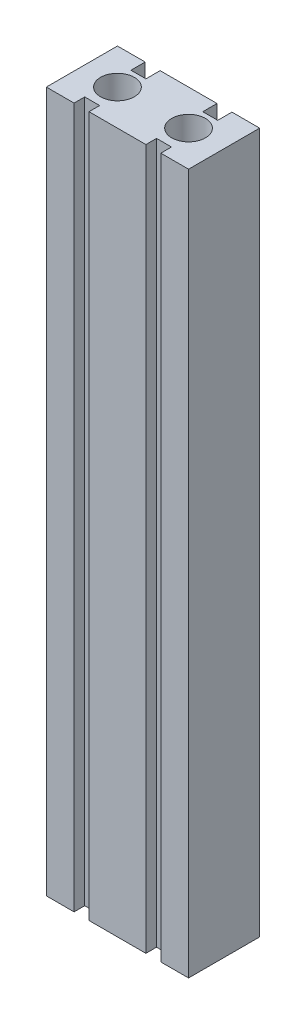
ISO-10303-21;
HEADER;
FILE_DESCRIPTION(('STEP AP214'),'2;1');
FILE_NAME('part.step','',(''),(''),'','','');
FILE_SCHEMA(('AUTOMOTIVE_DESIGN { 1 0 10303 214 1 1 1 1 }'));
ENDSEC;
DATA;
#1=APPLICATION_CONTEXT('core data for automotive mechanical design processes');
#2=APPLICATION_PROTOCOL_DEFINITION('international standard','automotive_design',2000,#1);
#3=PRODUCT_CONTEXT('',#1,'mechanical');
#4=PRODUCT('Part','Part','',(#3));
#5=PRODUCT_RELATED_PRODUCT_CATEGORY('part','',(#4));
#6=PRODUCT_DEFINITION_FORMATION('','',#4);
#7=PRODUCT_DEFINITION_CONTEXT('part definition',#1,'design');
#8=PRODUCT_DEFINITION('design','',#6,#7);
#9=PRODUCT_DEFINITION_SHAPE('','',#8);
#10=(LENGTH_UNIT() NAMED_UNIT(*) SI_UNIT(.MILLI.,.METRE.));
#11=(NAMED_UNIT(*) PLANE_ANGLE_UNIT() SI_UNIT($,.RADIAN.));
#12=(NAMED_UNIT(*) SI_UNIT($,.STERADIAN.) SOLID_ANGLE_UNIT());
#13=UNCERTAINTY_MEASURE_WITH_UNIT(LENGTH_MEASURE(1.E-05),#10,'distance_accuracy_value','');
#14=(GEOMETRIC_REPRESENTATION_CONTEXT(3) GLOBAL_UNCERTAINTY_ASSIGNED_CONTEXT((#13)) GLOBAL_UNIT_ASSIGNED_CONTEXT((#10,
#11,#12)) REPRESENTATION_CONTEXT('',''));
#15=CARTESIAN_POINT('',(0.,0.,0.));
#16=DIRECTION('',(0.,0.,1.));
#17=DIRECTION('',(1.,0.,0.));
#18=AXIS2_PLACEMENT_3D('',#15,#16,#17);
#19=CARTESIAN_POINT('',(-20.,197.,-10.));
#20=DIRECTION('',(0.,0.,1.));
#21=DIRECTION('',(1.,0.,0.));
#22=AXIS2_PLACEMENT_3D('',#19,#20,#21);
#23=PLANE('',#22);
#24=DIRECTION('',(-1.,0.,0.));
#25=VECTOR('',#24,1.);
#26=CARTESIAN_POINT('',(-20.,0.,-10.));
#27=LINE('',#26,#25);
#28=CARTESIAN_POINT('',(20.,0.,-10.));
#29=VERTEX_POINT('',#28);
#30=CARTESIAN_POINT('',(12.2,0.,-10.));
#31=VERTEX_POINT('',#30);
#32=EDGE_CURVE('E356',#29,#31,#27,.T.);
#33=ORIENTED_EDGE('',*,*,#32,.T.);
#34=DIRECTION('',(0.,-1.,0.));
#35=VECTOR('',#34,1.);
#36=CARTESIAN_POINT('',(12.2,197.,-10.));
#37=LINE('',#36,#35);
#38=CARTESIAN_POINT('',(12.2,197.,-10.));
#39=VERTEX_POINT('',#38);
#40=EDGE_CURVE('E234',#39,#31,#37,.T.);
#41=ORIENTED_EDGE('',*,*,#40,.F.);
#42=DIRECTION('',(-1.,0.,0.));
#43=VECTOR('',#42,1.);
#44=CARTESIAN_POINT('',(-20.,197.,-10.));
#45=LINE('',#44,#43);
#46=CARTESIAN_POINT('',(20.,197.,-10.));
#47=VERTEX_POINT('',#46);
#48=EDGE_CURVE('E337',#47,#39,#45,.T.);
#49=ORIENTED_EDGE('',*,*,#48,.F.);
#50=DIRECTION('',(0.,-1.,0.));
#51=VECTOR('',#50,1.);
#52=CARTESIAN_POINT('',(20.,197.,-10.));
#53=LINE('',#52,#51);
#54=EDGE_CURVE('E11',#47,#29,#53,.T.);
#55=ORIENTED_EDGE('',*,*,#54,.T.);
#56=EDGE_LOOP('',(#33,#41,#49,#55));
#57=FACE_BOUND('',#56,.T.);
#58=ADVANCED_FACE('F39',(#57),#23,.F.);
#59=CARTESIAN_POINT('',(-12.2,197.,-10.));
#60=VERTEX_POINT('',#59);
#61=CARTESIAN_POINT('',(-20.,197.,-10.));
#62=VERTEX_POINT('',#61);
#63=EDGE_CURVE('E335',#60,#62,#45,.T.);
#64=ORIENTED_EDGE('',*,*,#63,.F.);
#65=DIRECTION('',(0.,1.,0.));
#66=VECTOR('',#65,1.);
#67=CARTESIAN_POINT('',(-12.2,0.,-10.));
#68=LINE('',#67,#66);
#69=CARTESIAN_POINT('',(-12.2,0.,-10.));
#70=VERTEX_POINT('',#69);
#71=EDGE_CURVE('E226',#70,#60,#68,.T.);
#72=ORIENTED_EDGE('',*,*,#71,.F.);
#73=CARTESIAN_POINT('',(-20.,0.,-10.));
#74=VERTEX_POINT('',#73);
#75=EDGE_CURVE('E355',#70,#74,#27,.T.);
#76=ORIENTED_EDGE('',*,*,#75,.T.);
#77=DIRECTION('',(0.,-1.,0.));
#78=VECTOR('',#77,1.);
#79=CARTESIAN_POINT('',(-20.,197.,-10.));
#80=LINE('',#79,#78);
#81=EDGE_CURVE('E48',#62,#74,#80,.T.);
#82=ORIENTED_EDGE('',*,*,#81,.F.);
#83=EDGE_LOOP('',(#64,#72,#76,#82));
#84=FACE_BOUND('',#83,.T.);
#85=ADVANCED_FACE('F416',(#84),#23,.F.);
#86=CARTESIAN_POINT('',(-20.,197.,10.));
#87=DIRECTION('',(0.,0.,-1.));
#88=DIRECTION('',(-1.,0.,0.));
#89=AXIS2_PLACEMENT_3D('',#86,#87,#88);
#90=PLANE('',#89);
#91=DIRECTION('',(1.,0.,0.));
#92=VECTOR('',#91,1.);
#93=CARTESIAN_POINT('',(-20.,0.,10.));
#94=LINE('',#93,#92);
#95=CARTESIAN_POINT('',(-20.,0.,10.));
#96=VERTEX_POINT('',#95);
#97=CARTESIAN_POINT('',(-12.2,0.,10.));
#98=VERTEX_POINT('',#97);
#99=EDGE_CURVE('E336',#96,#98,#94,.T.);
#100=ORIENTED_EDGE('',*,*,#99,.T.);
#101=DIRECTION('',(0.,-1.,0.));
#102=VECTOR('',#101,1.);
#103=CARTESIAN_POINT('',(-12.2,0.,10.));
#104=LINE('',#103,#102);
#105=CARTESIAN_POINT('',(-12.2,197.,10.));
#106=VERTEX_POINT('',#105);
#107=EDGE_CURVE('E261',#106,#98,#104,.T.);
#108=ORIENTED_EDGE('',*,*,#107,.F.);
#109=DIRECTION('',(1.,0.,0.));
#110=VECTOR('',#109,1.);
#111=CARTESIAN_POINT('',(-20.,197.,10.));
#112=LINE('',#111,#110);
#113=CARTESIAN_POINT('',(-20.,197.,10.));
#114=VERTEX_POINT('',#113);
#115=EDGE_CURVE('E346',#114,#106,#112,.T.);
#116=ORIENTED_EDGE('',*,*,#115,.F.);
#117=DIRECTION('',(0.,-1.,0.));
#118=VECTOR('',#117,1.);
#119=CARTESIAN_POINT('',(-20.,197.,10.));
#120=LINE('',#119,#118);
#121=EDGE_CURVE('E371',#114,#96,#120,.T.);
#122=ORIENTED_EDGE('',*,*,#121,.T.);
#123=EDGE_LOOP('',(#100,#108,#116,#122));
#124=FACE_BOUND('',#123,.T.);
#125=ADVANCED_FACE('F391',(#124),#90,.F.);
#126=CARTESIAN_POINT('',(12.2,197.,10.));
#127=VERTEX_POINT('',#126);
#128=CARTESIAN_POINT('',(20.,197.,10.));
#129=VERTEX_POINT('',#128);
#130=EDGE_CURVE('E345',#127,#129,#112,.T.);
#131=ORIENTED_EDGE('',*,*,#130,.F.);
#132=DIRECTION('',(0.,1.,0.));
#133=VECTOR('',#132,1.);
#134=CARTESIAN_POINT('',(12.2,0.,10.));
#135=LINE('',#134,#133);
#136=CARTESIAN_POINT('',(12.2,0.,10.));
#137=VERTEX_POINT('',#136);
#138=EDGE_CURVE('E298',#137,#127,#135,.T.);
#139=ORIENTED_EDGE('',*,*,#138,.F.);
#140=CARTESIAN_POINT('',(20.,0.,10.));
#141=VERTEX_POINT('',#140);
#142=EDGE_CURVE('E363',#137,#141,#94,.T.);
#143=ORIENTED_EDGE('',*,*,#142,.T.);
#144=DIRECTION('',(0.,-1.,0.));
#145=VECTOR('',#144,1.);
#146=CARTESIAN_POINT('',(20.,197.,10.));
#147=LINE('',#146,#145);
#148=EDGE_CURVE('E350',#129,#141,#147,.T.);
#149=ORIENTED_EDGE('',*,*,#148,.F.);
#150=EDGE_LOOP('',(#131,#139,#143,#149));
#151=FACE_BOUND('',#150,.T.);
#152=ADVANCED_FACE('F445',(#151),#90,.F.);
#153=CARTESIAN_POINT('',(20.,197.,-10.));
#154=DIRECTION('',(-1.,0.,0.));
#155=DIRECTION('',(0.,0.,1.));
#156=AXIS2_PLACEMENT_3D('',#153,#154,#155);
#157=PLANE('',#156);
#158=DIRECTION('',(0.,0.,-1.));
#159=VECTOR('',#158,1.);
#160=CARTESIAN_POINT('',(20.,0.,-10.));
#161=LINE('',#160,#159);
#162=EDGE_CURVE('E319',#141,#29,#161,.T.);
#163=ORIENTED_EDGE('',*,*,#162,.T.);
#164=ORIENTED_EDGE('',*,*,#54,.F.);
#165=DIRECTION('',(0.,0.,-1.));
#166=VECTOR('',#165,1.);
#167=CARTESIAN_POINT('',(20.,197.,-10.));
#168=LINE('',#167,#166);
#169=EDGE_CURVE('E331',#129,#47,#168,.T.);
#170=ORIENTED_EDGE('',*,*,#169,.F.);
#171=ORIENTED_EDGE('',*,*,#148,.T.);
#172=EDGE_LOOP('',(#163,#164,#170,#171));
#173=FACE_BOUND('',#172,.T.);
#174=ADVANCED_FACE('F41',(#173),#157,.F.);
#175=CARTESIAN_POINT('',(8.,197.,-10.));
#176=VERTEX_POINT('',#175);
#177=CARTESIAN_POINT('',(-8.,197.,-10.));
#178=VERTEX_POINT('',#177);
#179=EDGE_CURVE('E342',#176,#178,#45,.T.);
#180=ORIENTED_EDGE('',*,*,#179,.F.);
#181=DIRECTION('',(0.,1.,0.));
#182=VECTOR('',#181,1.);
#183=CARTESIAN_POINT('',(8.,0.,-10.));
#184=LINE('',#183,#182);
#185=CARTESIAN_POINT('',(8.,0.,-10.));
#186=VERTEX_POINT('',#185);
#187=EDGE_CURVE('E409',#186,#176,#184,.T.);
#188=ORIENTED_EDGE('',*,*,#187,.F.);
#189=CARTESIAN_POINT('',(-8.,0.,-10.));
#190=VERTEX_POINT('',#189);
#191=EDGE_CURVE('E201',#186,#190,#27,.T.);
#192=ORIENTED_EDGE('',*,*,#191,.T.);
#193=DIRECTION('',(0.,-1.,0.));
#194=VECTOR('',#193,1.);
#195=CARTESIAN_POINT('',(-8.,197.,-10.));
#196=LINE('',#195,#194);
#197=EDGE_CURVE('E217',#178,#190,#196,.T.);
#198=ORIENTED_EDGE('',*,*,#197,.F.);
#199=EDGE_LOOP('',(#180,#188,#192,#198));
#200=FACE_BOUND('',#199,.T.);
#201=ADVANCED_FACE('F408',(#200),#23,.F.);
#202=CARTESIAN_POINT('',(-20.,197.,-10.));
#203=DIRECTION('',(1.,0.,0.));
#204=DIRECTION('',(0.,0.,-1.));
#205=AXIS2_PLACEMENT_3D('',#202,#203,#204);
#206=PLANE('',#205);
#207=DIRECTION('',(0.,0.,1.));
#208=VECTOR('',#207,1.);
#209=CARTESIAN_POINT('',(-20.,0.,-10.));
#210=LINE('',#209,#208);
#211=EDGE_CURVE('E360',#74,#96,#210,.T.);
#212=ORIENTED_EDGE('',*,*,#211,.T.);
#213=ORIENTED_EDGE('',*,*,#121,.F.);
#214=DIRECTION('',(0.,0.,1.));
#215=VECTOR('',#214,1.);
#216=CARTESIAN_POINT('',(-20.,197.,-10.));
#217=LINE('',#216,#215);
#218=EDGE_CURVE('E341',#62,#114,#217,.T.);
#219=ORIENTED_EDGE('',*,*,#218,.F.);
#220=ORIENTED_EDGE('',*,*,#81,.T.);
#221=EDGE_LOOP('',(#212,#213,#219,#220));
#222=FACE_BOUND('',#221,.T.);
#223=ADVANCED_FACE('F380',(#222),#206,.F.);
#224=CARTESIAN_POINT('',(-8.,197.,10.));
#225=VERTEX_POINT('',#224);
#226=CARTESIAN_POINT('',(8.,197.,10.));
#227=VERTEX_POINT('',#226);
#228=EDGE_CURVE('E351',#225,#227,#112,.T.);
#229=ORIENTED_EDGE('',*,*,#228,.F.);
#230=DIRECTION('',(0.,1.,0.));
#231=VECTOR('',#230,1.);
#232=CARTESIAN_POINT('',(-8.,0.,10.));
#233=LINE('',#232,#231);
#234=CARTESIAN_POINT('',(-8.,0.,10.));
#235=VERTEX_POINT('',#234);
#236=EDGE_CURVE('E248',#235,#225,#233,.T.);
#237=ORIENTED_EDGE('',*,*,#236,.F.);
#238=CARTESIAN_POINT('',(8.,0.,10.));
#239=VERTEX_POINT('',#238);
#240=EDGE_CURVE('E367',#235,#239,#94,.T.);
#241=ORIENTED_EDGE('',*,*,#240,.T.);
#242=DIRECTION('',(0.,-1.,0.));
#243=VECTOR('',#242,1.);
#244=CARTESIAN_POINT('',(8.,0.,10.));
#245=LINE('',#244,#243);
#246=EDGE_CURVE('E286',#227,#239,#245,.T.);
#247=ORIENTED_EDGE('',*,*,#246,.F.);
#248=EDGE_LOOP('',(#229,#237,#241,#247));
#249=FACE_BOUND('',#248,.T.);
#250=ADVANCED_FACE('F427',(#249),#90,.F.);
#251=CARTESIAN_POINT('',(0.,197.,0.));
#252=DIRECTION('',(0.,1.,0.));
#253=DIRECTION('',(0.,0.,1.));
#254=AXIS2_PLACEMENT_3D('',#251,#252,#253);
#255=PLANE('',#254);
#256=DIRECTION('',(0.,0.,-1.));
#257=VECTOR('',#256,1.);
#258=CARTESIAN_POINT('',(12.2,197.,-6.));
#259=LINE('',#258,#257);
#260=CARTESIAN_POINT('',(12.2,197.,-6.));
#261=VERTEX_POINT('',#260);
#262=EDGE_CURVE('E207',#261,#39,#259,.T.);
#263=ORIENTED_EDGE('',*,*,#262,.F.);
#264=DIRECTION('',(1.,0.,0.));
#265=VECTOR('',#264,1.);
#266=CARTESIAN_POINT('',(8.,197.,-6.));
#267=LINE('',#266,#265);
#268=CARTESIAN_POINT('',(8.,197.,-6.));
#269=VERTEX_POINT('',#268);
#270=EDGE_CURVE('E187',#269,#261,#267,.T.);
#271=ORIENTED_EDGE('',*,*,#270,.F.);
#272=DIRECTION('',(0.,0.,-1.));
#273=VECTOR('',#272,1.);
#274=CARTESIAN_POINT('',(8.,197.,-6.));
#275=LINE('',#274,#273);
#276=EDGE_CURVE('E184',#269,#176,#275,.T.);
#277=ORIENTED_EDGE('',*,*,#276,.T.);
#278=ORIENTED_EDGE('',*,*,#179,.T.);
#279=DIRECTION('',(0.,0.,-1.));
#280=VECTOR('',#279,1.);
#281=CARTESIAN_POINT('',(-8.,197.,-6.));
#282=LINE('',#281,#280);
#283=CARTESIAN_POINT('',(-8.,197.,-6.));
#284=VERTEX_POINT('',#283);
#285=EDGE_CURVE('E238',#284,#178,#282,.T.);
#286=ORIENTED_EDGE('',*,*,#285,.F.);
#287=DIRECTION('',(1.,0.,0.));
#288=VECTOR('',#287,1.);
#289=CARTESIAN_POINT('',(-12.2,197.,-6.));
#290=LINE('',#289,#288);
#291=CARTESIAN_POINT('',(-12.2,197.,-6.));
#292=VERTEX_POINT('',#291);
#293=EDGE_CURVE('E216',#292,#284,#290,.T.);
#294=ORIENTED_EDGE('',*,*,#293,.F.);
#295=DIRECTION('',(0.,0.,-1.));
#296=VECTOR('',#295,1.);
#297=CARTESIAN_POINT('',(-12.2,197.,-6.));
#298=LINE('',#297,#296);
#299=EDGE_CURVE('E225',#292,#60,#298,.T.);
#300=ORIENTED_EDGE('',*,*,#299,.T.);
#301=ORIENTED_EDGE('',*,*,#63,.T.);
#302=ORIENTED_EDGE('',*,*,#218,.T.);
#303=ORIENTED_EDGE('',*,*,#115,.T.);
#304=DIRECTION('',(0.,0.,1.));
#305=VECTOR('',#304,1.);
#306=CARTESIAN_POINT('',(-12.2,197.,7.));
#307=LINE('',#306,#305);
#308=CARTESIAN_POINT('',(-12.2,197.,7.));
#309=VERTEX_POINT('',#308);
#310=EDGE_CURVE('E267',#309,#106,#307,.T.);
#311=ORIENTED_EDGE('',*,*,#310,.F.);
#312=DIRECTION('',(-1.,0.,0.));
#313=VECTOR('',#312,1.);
#314=CARTESIAN_POINT('',(-12.2,197.,7.));
#315=LINE('',#314,#313);
#316=CARTESIAN_POINT('',(-8.,197.,7.));
#317=VERTEX_POINT('',#316);
#318=EDGE_CURVE('E256',#317,#309,#315,.T.);
#319=ORIENTED_EDGE('',*,*,#318,.F.);
#320=DIRECTION('',(0.,0.,1.));
#321=VECTOR('',#320,1.);
#322=CARTESIAN_POINT('',(-8.,197.,7.));
#323=LINE('',#322,#321);
#324=EDGE_CURVE('E271',#317,#225,#323,.T.);
#325=ORIENTED_EDGE('',*,*,#324,.T.);
#326=ORIENTED_EDGE('',*,*,#228,.T.);
#327=DIRECTION('',(0.,0.,1.));
#328=VECTOR('',#327,1.);
#329=CARTESIAN_POINT('',(8.,197.,7.));
#330=LINE('',#329,#328);
#331=CARTESIAN_POINT('',(8.,197.,7.));
#332=VERTEX_POINT('',#331);
#333=EDGE_CURVE('E309',#332,#227,#330,.T.);
#334=ORIENTED_EDGE('',*,*,#333,.F.);
#335=DIRECTION('',(-1.,0.,0.));
#336=VECTOR('',#335,1.);
#337=CARTESIAN_POINT('',(12.2,197.,7.));
#338=LINE('',#337,#336);
#339=CARTESIAN_POINT('',(12.2,197.,7.));
#340=VERTEX_POINT('',#339);
#341=EDGE_CURVE('E285',#340,#332,#338,.T.);
#342=ORIENTED_EDGE('',*,*,#341,.F.);
#343=DIRECTION('',(0.,0.,1.));
#344=VECTOR('',#343,1.);
#345=CARTESIAN_POINT('',(12.2,197.,7.));
#346=LINE('',#345,#344);
#347=EDGE_CURVE('E297',#340,#127,#346,.T.);
#348=ORIENTED_EDGE('',*,*,#347,.T.);
#349=ORIENTED_EDGE('',*,*,#130,.T.);
#350=ORIENTED_EDGE('',*,*,#169,.T.);
#351=ORIENTED_EDGE('',*,*,#48,.T.);
#352=EDGE_LOOP('',(#263,#271,#277,#278,#286,#294,#300,#301,#302,#303,#311,#319,#325,#326,#334,
#342,#348,#349,#350,#351));
#353=FACE_BOUND('',#352,.T.);
#354=CARTESIAN_POINT('',(-10.,197.,0.));
#355=DIRECTION('',(0.,-1.,0.));
#356=DIRECTION('',(0.,0.,-1.));
#357=AXIS2_PLACEMENT_3D('',#354,#355,#356);
#358=CIRCLE('',#357,4.75);
#359=CARTESIAN_POINT('',(-10.,197.,-4.75));
#360=VERTEX_POINT('',#359);
#361=EDGE_CURVE('E315',#360,#360,#358,.T.);
#362=ORIENTED_EDGE('',*,*,#361,.T.);
#363=EDGE_LOOP('',(#362));
#364=FACE_BOUND('',#363,.T.);
#365=CARTESIAN_POINT('',(10.,197.,0.));
#366=DIRECTION('',(0.,-1.,0.));
#367=DIRECTION('',(0.,0.,1.));
#368=AXIS2_PLACEMENT_3D('',#365,#366,#367);
#369=CIRCLE('',#368,4.75);
#370=CARTESIAN_POINT('',(10.,197.,4.75));
#371=VERTEX_POINT('',#370);
#372=EDGE_CURVE('E324',#371,#371,#369,.T.);
#373=ORIENTED_EDGE('',*,*,#372,.T.);
#374=EDGE_LOOP('',(#373));
#375=FACE_BOUND('',#374,.T.);
#376=ADVANCED_FACE('F396',(#353,#364,#375),#255,.T.);
#377=CARTESIAN_POINT('',(0.,0.,0.));
#378=DIRECTION('',(0.,1.,0.));
#379=DIRECTION('',(0.,0.,1.));
#380=AXIS2_PLACEMENT_3D('',#377,#378,#379);
#381=PLANE('',#380);
#382=DIRECTION('',(-1.,0.,0.));
#383=VECTOR('',#382,1.);
#384=CARTESIAN_POINT('',(12.2,0.,-6.));
#385=LINE('',#384,#383);
#386=CARTESIAN_POINT('',(12.2,0.,-6.));
#387=VERTEX_POINT('',#386);
#388=CARTESIAN_POINT('',(8.,0.,-6.));
#389=VERTEX_POINT('',#388);
#390=EDGE_CURVE('E188',#387,#389,#385,.T.);
#391=ORIENTED_EDGE('',*,*,#390,.F.);
#392=DIRECTION('',(0.,0.,-1.));
#393=VECTOR('',#392,1.);
#394=CARTESIAN_POINT('',(12.2,0.,-6.));
#395=LINE('',#394,#393);
#396=EDGE_CURVE('E203',#387,#31,#395,.T.);
#397=ORIENTED_EDGE('',*,*,#396,.T.);
#398=ORIENTED_EDGE('',*,*,#32,.F.);
#399=ORIENTED_EDGE('',*,*,#162,.F.);
#400=ORIENTED_EDGE('',*,*,#142,.F.);
#401=DIRECTION('',(0.,0.,1.));
#402=VECTOR('',#401,1.);
#403=CARTESIAN_POINT('',(12.2,0.,7.));
#404=LINE('',#403,#402);
#405=CARTESIAN_POINT('',(12.2,0.,7.));
#406=VERTEX_POINT('',#405);
#407=EDGE_CURVE('E264',#406,#137,#404,.T.);
#408=ORIENTED_EDGE('',*,*,#407,.F.);
#409=DIRECTION('',(1.,0.,0.));
#410=VECTOR('',#409,1.);
#411=CARTESIAN_POINT('',(12.2,0.,7.));
#412=LINE('',#411,#410);
#413=CARTESIAN_POINT('',(8.,0.,7.));
#414=VERTEX_POINT('',#413);
#415=EDGE_CURVE('E293',#414,#406,#412,.T.);
#416=ORIENTED_EDGE('',*,*,#415,.F.);
#417=DIRECTION('',(0.,0.,1.));
#418=VECTOR('',#417,1.);
#419=CARTESIAN_POINT('',(8.,0.,7.));
#420=LINE('',#419,#418);
#421=EDGE_CURVE('E305',#414,#239,#420,.T.);
#422=ORIENTED_EDGE('',*,*,#421,.T.);
#423=ORIENTED_EDGE('',*,*,#240,.F.);
#424=DIRECTION('',(0.,0.,1.));
#425=VECTOR('',#424,1.);
#426=CARTESIAN_POINT('',(-8.,0.,7.));
#427=LINE('',#426,#425);
#428=CARTESIAN_POINT('',(-8.,0.,7.));
#429=VERTEX_POINT('',#428);
#430=EDGE_CURVE('E275',#429,#235,#427,.T.);
#431=ORIENTED_EDGE('',*,*,#430,.F.);
#432=DIRECTION('',(1.,0.,0.));
#433=VECTOR('',#432,1.);
#434=CARTESIAN_POINT('',(-12.2,0.,7.));
#435=LINE('',#434,#433);
#436=CARTESIAN_POINT('',(-12.2,0.,7.));
#437=VERTEX_POINT('',#436);
#438=EDGE_CURVE('E247',#437,#429,#435,.T.);
#439=ORIENTED_EDGE('',*,*,#438,.F.);
#440=DIRECTION('',(0.,0.,1.));
#441=VECTOR('',#440,1.);
#442=CARTESIAN_POINT('',(-12.2,0.,7.));
#443=LINE('',#442,#441);
#444=EDGE_CURVE('E260',#437,#98,#443,.T.);
#445=ORIENTED_EDGE('',*,*,#444,.T.);
#446=ORIENTED_EDGE('',*,*,#99,.F.);
#447=ORIENTED_EDGE('',*,*,#211,.F.);
#448=ORIENTED_EDGE('',*,*,#75,.F.);
#449=DIRECTION('',(0.,0.,-1.));
#450=VECTOR('',#449,1.);
#451=CARTESIAN_POINT('',(-12.2,0.,-6.));
#452=LINE('',#451,#450);
#453=CARTESIAN_POINT('',(-12.2,0.,-6.));
#454=VERTEX_POINT('',#453);
#455=EDGE_CURVE('E231',#454,#70,#452,.T.);
#456=ORIENTED_EDGE('',*,*,#455,.F.);
#457=DIRECTION('',(-1.,0.,0.));
#458=VECTOR('',#457,1.);
#459=CARTESIAN_POINT('',(-8.,0.,-6.));
#460=LINE('',#459,#458);
#461=CARTESIAN_POINT('',(-8.,0.,-6.));
#462=VERTEX_POINT('',#461);
#463=EDGE_CURVE('E222',#462,#454,#460,.T.);
#464=ORIENTED_EDGE('',*,*,#463,.F.);
#465=DIRECTION('',(0.,0.,-1.));
#466=VECTOR('',#465,1.);
#467=CARTESIAN_POINT('',(-8.,0.,-6.));
#468=LINE('',#467,#466);
#469=EDGE_CURVE('E235',#462,#190,#468,.T.);
#470=ORIENTED_EDGE('',*,*,#469,.T.);
#471=ORIENTED_EDGE('',*,*,#191,.F.);
#472=DIRECTION('',(0.,0.,-1.));
#473=VECTOR('',#472,1.);
#474=CARTESIAN_POINT('',(8.,0.,-6.));
#475=LINE('',#474,#473);
#476=EDGE_CURVE('E181',#389,#186,#475,.T.);
#477=ORIENTED_EDGE('',*,*,#476,.F.);
#478=EDGE_LOOP('',(#391,#397,#398,#399,#400,#408,#416,#422,#423,#431,#439,#445,#446,#447,#448,
#456,#464,#470,#471,#477));
#479=FACE_BOUND('',#478,.T.);
#480=CARTESIAN_POINT('',(-10.,0.,0.));
#481=DIRECTION('',(0.,-1.,0.));
#482=DIRECTION('',(0.,0.,-1.));
#483=AXIS2_PLACEMENT_3D('',#480,#481,#482);
#484=CIRCLE('',#483,4.75);
#485=CARTESIAN_POINT('',(-10.,0.,-4.75));
#486=VERTEX_POINT('',#485);
#487=EDGE_CURVE('E320',#486,#486,#484,.T.);
#488=ORIENTED_EDGE('',*,*,#487,.F.);
#489=EDGE_LOOP('',(#488));
#490=FACE_BOUND('',#489,.T.);
#491=CARTESIAN_POINT('',(10.,0.,0.));
#492=DIRECTION('',(0.,-1.,0.));
#493=DIRECTION('',(0.,0.,1.));
#494=AXIS2_PLACEMENT_3D('',#491,#492,#493);
#495=CIRCLE('',#494,4.75);
#496=CARTESIAN_POINT('',(10.,0.,4.75));
#497=VERTEX_POINT('',#496);
#498=EDGE_CURVE('E270',#497,#497,#495,.T.);
#499=ORIENTED_EDGE('',*,*,#498,.F.);
#500=EDGE_LOOP('',(#499));
#501=FACE_BOUND('',#500,.T.);
#502=ADVANCED_FACE('F197',(#479,#490,#501),#381,.F.);
#503=CARTESIAN_POINT('',(10.,197.,0.));
#504=DIRECTION('',(0.,-1.,0.));
#505=DIRECTION('',(0.,0.,-1.));
#506=AXIS2_PLACEMENT_3D('',#503,#504,#505);
#507=CYLINDRICAL_SURFACE('',#506,4.75);
#508=ORIENTED_EDGE('',*,*,#372,.F.);
#509=EDGE_LOOP('',(#508));
#510=FACE_BOUND('',#509,.T.);
#511=ORIENTED_EDGE('',*,*,#498,.T.);
#512=EDGE_LOOP('',(#511));
#513=FACE_BOUND('',#512,.T.);
#514=ADVANCED_FACE('F503',(#510,#513),#507,.F.);
#515=CARTESIAN_POINT('',(-10.,197.,0.));
#516=DIRECTION('',(0.,-1.,0.));
#517=DIRECTION('',(0.,0.,-1.));
#518=AXIS2_PLACEMENT_3D('',#515,#516,#517);
#519=CYLINDRICAL_SURFACE('',#518,4.75);
#520=ORIENTED_EDGE('',*,*,#361,.F.);
#521=EDGE_LOOP('',(#520));
#522=FACE_BOUND('',#521,.T.);
#523=ORIENTED_EDGE('',*,*,#487,.T.);
#524=EDGE_LOOP('',(#523));
#525=FACE_BOUND('',#524,.T.);
#526=ADVANCED_FACE('F507',(#522,#525),#519,.F.);
#527=CARTESIAN_POINT('',(12.2,0.,7.));
#528=DIRECTION('',(1.,0.,0.));
#529=DIRECTION('',(0.,0.,-1.));
#530=AXIS2_PLACEMENT_3D('',#527,#528,#529);
#531=PLANE('',#530);
#532=ORIENTED_EDGE('',*,*,#138,.T.);
#533=ORIENTED_EDGE('',*,*,#347,.F.);
#534=DIRECTION('',(0.,1.,0.));
#535=VECTOR('',#534,1.);
#536=CARTESIAN_POINT('',(12.2,0.,7.));
#537=LINE('',#536,#535);
#538=EDGE_CURVE('E281',#406,#340,#537,.T.);
#539=ORIENTED_EDGE('',*,*,#538,.F.);
#540=ORIENTED_EDGE('',*,*,#407,.T.);
#541=EDGE_LOOP('',(#532,#533,#539,#540));
#542=FACE_BOUND('',#541,.T.);
#543=ADVANCED_FACE('F463',(#542),#531,.F.);
#544=CARTESIAN_POINT('',(8.,0.,7.));
#545=DIRECTION('',(-1.,0.,0.));
#546=DIRECTION('',(0.,0.,1.));
#547=AXIS2_PLACEMENT_3D('',#544,#545,#546);
#548=PLANE('',#547);
#549=ORIENTED_EDGE('',*,*,#246,.T.);
#550=ORIENTED_EDGE('',*,*,#421,.F.);
#551=DIRECTION('',(0.,-1.,0.));
#552=VECTOR('',#551,1.);
#553=CARTESIAN_POINT('',(8.,0.,7.));
#554=LINE('',#553,#552);
#555=EDGE_CURVE('E290',#332,#414,#554,.T.);
#556=ORIENTED_EDGE('',*,*,#555,.F.);
#557=ORIENTED_EDGE('',*,*,#333,.T.);
#558=EDGE_LOOP('',(#549,#550,#556,#557));
#559=FACE_BOUND('',#558,.T.);
#560=ADVANCED_FACE('F434',(#559),#548,.F.);
#561=CARTESIAN_POINT('',(0.,0.,7.));
#562=DIRECTION('',(0.,0.,1.));
#563=DIRECTION('',(1.,0.,0.));
#564=AXIS2_PLACEMENT_3D('',#561,#562,#563);
#565=PLANE('',#564);
#566=ORIENTED_EDGE('',*,*,#538,.T.);
#567=ORIENTED_EDGE('',*,*,#341,.T.);
#568=ORIENTED_EDGE('',*,*,#555,.T.);
#569=ORIENTED_EDGE('',*,*,#415,.T.);
#570=EDGE_LOOP('',(#566,#567,#568,#569));
#571=FACE_BOUND('',#570,.T.);
#572=ADVANCED_FACE('F465',(#571),#565,.T.);
#573=CARTESIAN_POINT('',(-12.2,0.,7.));
#574=DIRECTION('',(-1.,0.,0.));
#575=DIRECTION('',(0.,0.,1.));
#576=AXIS2_PLACEMENT_3D('',#573,#574,#575);
#577=PLANE('',#576);
#578=ORIENTED_EDGE('',*,*,#107,.T.);
#579=ORIENTED_EDGE('',*,*,#444,.F.);
#580=DIRECTION('',(0.,-1.,0.));
#581=VECTOR('',#580,1.);
#582=CARTESIAN_POINT('',(-12.2,0.,7.));
#583=LINE('',#582,#581);
#584=EDGE_CURVE('E244',#309,#437,#583,.T.);
#585=ORIENTED_EDGE('',*,*,#584,.F.);
#586=ORIENTED_EDGE('',*,*,#310,.T.);
#587=EDGE_LOOP('',(#578,#579,#585,#586));
#588=FACE_BOUND('',#587,.T.);
#589=ADVANCED_FACE('F467',(#588),#577,.F.);
#590=CARTESIAN_POINT('',(-8.,0.,7.));
#591=DIRECTION('',(1.,0.,0.));
#592=DIRECTION('',(0.,0.,-1.));
#593=AXIS2_PLACEMENT_3D('',#590,#591,#592);
#594=PLANE('',#593);
#595=ORIENTED_EDGE('',*,*,#236,.T.);
#596=ORIENTED_EDGE('',*,*,#324,.F.);
#597=DIRECTION('',(0.,1.,0.));
#598=VECTOR('',#597,1.);
#599=CARTESIAN_POINT('',(-8.,0.,7.));
#600=LINE('',#599,#598);
#601=EDGE_CURVE('E252',#429,#317,#600,.T.);
#602=ORIENTED_EDGE('',*,*,#601,.F.);
#603=ORIENTED_EDGE('',*,*,#430,.T.);
#604=EDGE_LOOP('',(#595,#596,#602,#603));
#605=FACE_BOUND('',#604,.T.);
#606=ADVANCED_FACE('F473',(#605),#594,.F.);
#607=CARTESIAN_POINT('',(0.,0.,7.));
#608=DIRECTION('',(0.,0.,-1.));
#609=DIRECTION('',(-1.,0.,0.));
#610=AXIS2_PLACEMENT_3D('',#607,#608,#609);
#611=PLANE('',#610);
#612=ORIENTED_EDGE('',*,*,#584,.T.);
#613=ORIENTED_EDGE('',*,*,#438,.T.);
#614=ORIENTED_EDGE('',*,*,#601,.T.);
#615=ORIENTED_EDGE('',*,*,#318,.T.);
#616=EDGE_LOOP('',(#612,#613,#614,#615));
#617=FACE_BOUND('',#616,.T.);
#618=ADVANCED_FACE('F540',(#617),#611,.F.);
#619=CARTESIAN_POINT('',(-12.2,0.,-6.));
#620=DIRECTION('',(-1.,0.,0.));
#621=DIRECTION('',(0.,0.,1.));
#622=AXIS2_PLACEMENT_3D('',#619,#620,#621);
#623=PLANE('',#622);
#624=ORIENTED_EDGE('',*,*,#71,.T.);
#625=ORIENTED_EDGE('',*,*,#299,.F.);
#626=DIRECTION('',(0.,1.,0.));
#627=VECTOR('',#626,1.);
#628=CARTESIAN_POINT('',(-12.2,0.,-6.));
#629=LINE('',#628,#627);
#630=EDGE_CURVE('E212',#454,#292,#629,.T.);
#631=ORIENTED_EDGE('',*,*,#630,.F.);
#632=ORIENTED_EDGE('',*,*,#455,.T.);
#633=EDGE_LOOP('',(#624,#625,#631,#632));
#634=FACE_BOUND('',#633,.T.);
#635=ADVANCED_FACE('F415',(#634),#623,.F.);
#636=CARTESIAN_POINT('',(-8.,197.,-6.));
#637=DIRECTION('',(1.,0.,0.));
#638=DIRECTION('',(0.,0.,-1.));
#639=AXIS2_PLACEMENT_3D('',#636,#637,#638);
#640=PLANE('',#639);
#641=ORIENTED_EDGE('',*,*,#197,.T.);
#642=ORIENTED_EDGE('',*,*,#469,.F.);
#643=DIRECTION('',(0.,-1.,0.));
#644=VECTOR('',#643,1.);
#645=CARTESIAN_POINT('',(-8.,197.,-6.));
#646=LINE('',#645,#644);
#647=EDGE_CURVE('E63',#284,#462,#646,.T.);
#648=ORIENTED_EDGE('',*,*,#647,.F.);
#649=ORIENTED_EDGE('',*,*,#285,.T.);
#650=EDGE_LOOP('',(#641,#642,#648,#649));
#651=FACE_BOUND('',#650,.T.);
#652=ADVANCED_FACE('F411',(#651),#640,.F.);
#653=CARTESIAN_POINT('',(0.,0.,-6.));
#654=DIRECTION('',(0.,0.,-1.));
#655=DIRECTION('',(-1.,0.,0.));
#656=AXIS2_PLACEMENT_3D('',#653,#654,#655);
#657=PLANE('',#656);
#658=ORIENTED_EDGE('',*,*,#630,.T.);
#659=ORIENTED_EDGE('',*,*,#293,.T.);
#660=ORIENTED_EDGE('',*,*,#647,.T.);
#661=ORIENTED_EDGE('',*,*,#463,.T.);
#662=EDGE_LOOP('',(#658,#659,#660,#661));
#663=FACE_BOUND('',#662,.T.);
#664=ADVANCED_FACE('F413',(#663),#657,.T.);
#665=CARTESIAN_POINT('',(12.2,197.,-6.));
#666=DIRECTION('',(1.,0.,0.));
#667=DIRECTION('',(0.,0.,-1.));
#668=AXIS2_PLACEMENT_3D('',#665,#666,#667);
#669=PLANE('',#668);
#670=ORIENTED_EDGE('',*,*,#40,.T.);
#671=ORIENTED_EDGE('',*,*,#396,.F.);
#672=DIRECTION('',(0.,-1.,0.));
#673=VECTOR('',#672,1.);
#674=CARTESIAN_POINT('',(12.2,197.,-6.));
#675=LINE('',#674,#673);
#676=EDGE_CURVE('E55',#261,#387,#675,.T.);
#677=ORIENTED_EDGE('',*,*,#676,.F.);
#678=ORIENTED_EDGE('',*,*,#262,.T.);
#679=EDGE_LOOP('',(#670,#671,#677,#678));
#680=FACE_BOUND('',#679,.T.);
#681=ADVANCED_FACE('F461',(#680),#669,.F.);
#682=CARTESIAN_POINT('',(8.,0.,-6.));
#683=DIRECTION('',(-1.,0.,0.));
#684=DIRECTION('',(0.,0.,1.));
#685=AXIS2_PLACEMENT_3D('',#682,#683,#684);
#686=PLANE('',#685);
#687=ORIENTED_EDGE('',*,*,#187,.T.);
#688=ORIENTED_EDGE('',*,*,#276,.F.);
#689=DIRECTION('',(0.,1.,0.));
#690=VECTOR('',#689,1.);
#691=CARTESIAN_POINT('',(8.,0.,-6.));
#692=LINE('',#691,#690);
#693=EDGE_CURVE('E178',#389,#269,#692,.T.);
#694=ORIENTED_EDGE('',*,*,#693,.F.);
#695=ORIENTED_EDGE('',*,*,#476,.T.);
#696=EDGE_LOOP('',(#687,#688,#694,#695));
#697=FACE_BOUND('',#696,.T.);
#698=ADVANCED_FACE('F179',(#697),#686,.F.);
#699=CARTESIAN_POINT('',(0.,0.,-6.));
#700=DIRECTION('',(0.,0.,-1.));
#701=DIRECTION('',(-1.,0.,0.));
#702=AXIS2_PLACEMENT_3D('',#699,#700,#701);
#703=PLANE('',#702);
#704=ORIENTED_EDGE('',*,*,#676,.T.);
#705=ORIENTED_EDGE('',*,*,#390,.T.);
#706=ORIENTED_EDGE('',*,*,#693,.T.);
#707=ORIENTED_EDGE('',*,*,#270,.T.);
#708=EDGE_LOOP('',(#704,#705,#706,#707));
#709=FACE_BOUND('',#708,.T.);
#710=ADVANCED_FACE('F191',(#709),#703,.T.);
#711=CLOSED_SHELL('',(#58,#85,#125,#152,#174,#201,#223,#250,#376,#502,#514,#526,#543,#560,#572,
#589,#606,#618,#635,#652,#664,#681,#698,#710));
#712=MANIFOLD_SOLID_BREP('B2',#711);
#713=ADVANCED_BREP_SHAPE_REPRESENTATION('',(#18,#712),#14);
#714=SHAPE_DEFINITION_REPRESENTATION(#9,#713);
ENDSEC;
END-ISO-10303-21;
